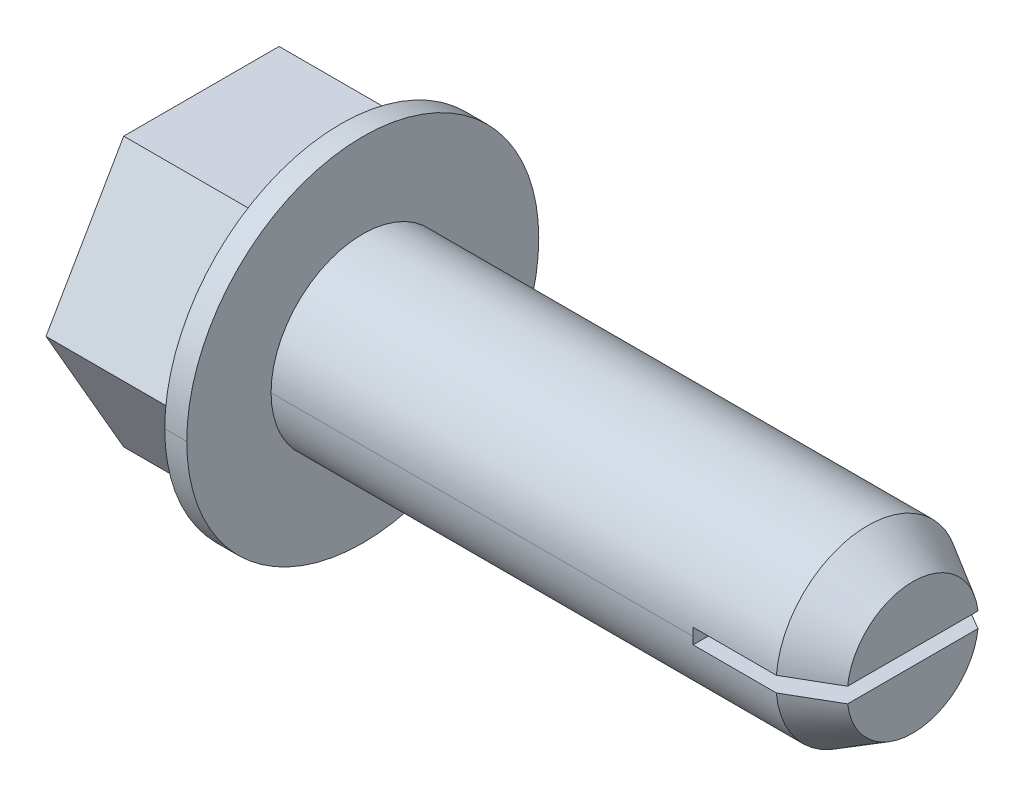
ISO-10303-21;
HEADER;
FILE_DESCRIPTION(('STEP AP214'),'2;1');
FILE_NAME('part.step','',(''),(''),'','','');
FILE_SCHEMA(('AUTOMOTIVE_DESIGN { 1 0 10303 214 1 1 1 1 }'));
ENDSEC;
DATA;
#1=APPLICATION_CONTEXT('core data for automotive mechanical design processes');
#2=APPLICATION_PROTOCOL_DEFINITION('international standard','automotive_design',2000,#1);
#3=PRODUCT_CONTEXT('',#1,'mechanical');
#4=PRODUCT('Part','Part','',(#3));
#5=PRODUCT_RELATED_PRODUCT_CATEGORY('part','',(#4));
#6=PRODUCT_DEFINITION_FORMATION('','',#4);
#7=PRODUCT_DEFINITION_CONTEXT('part definition',#1,'design');
#8=PRODUCT_DEFINITION('design','',#6,#7);
#9=PRODUCT_DEFINITION_SHAPE('','',#8);
#10=(LENGTH_UNIT() NAMED_UNIT(*) SI_UNIT(.MILLI.,.METRE.));
#11=(NAMED_UNIT(*) PLANE_ANGLE_UNIT() SI_UNIT($,.RADIAN.));
#12=(NAMED_UNIT(*) SI_UNIT($,.STERADIAN.) SOLID_ANGLE_UNIT());
#13=UNCERTAINTY_MEASURE_WITH_UNIT(LENGTH_MEASURE(1.E-05),#10,'distance_accuracy_value','');
#14=(GEOMETRIC_REPRESENTATION_CONTEXT(3) GLOBAL_UNCERTAINTY_ASSIGNED_CONTEXT((#13)) GLOBAL_UNIT_ASSIGNED_CONTEXT((#10,
#11,#12)) REPRESENTATION_CONTEXT('',''));
#15=CARTESIAN_POINT('',(0.,0.,0.));
#16=DIRECTION('',(0.,0.,1.));
#17=DIRECTION('',(1.,0.,0.));
#18=AXIS2_PLACEMENT_3D('',#15,#16,#17);
#19=CARTESIAN_POINT('',(14.605,-0.264583333333334,-6.096));
#20=DIRECTION('',(0.,-1.,0.));
#21=DIRECTION('',(0.,0.,-1.));
#22=AXIS2_PLACEMENT_3D('',#19,#20,#21);
#23=PLANE('',#22);
#24=CARTESIAN_POINT('',(17.4882097868151,-0.264583333333334,3.16395648827891));
#25=CARTESIAN_POINT('',(18.0089885370992,-0.264583333333334,2.86223526832155));
#26=CARTESIAN_POINT('',(18.5296581049854,-0.264583333333334,2.56032561142075));
#27=CARTESIAN_POINT('',(19.05,-0.264583333333334,2.25785042678257));
#28=(BOUNDED_CURVE() B_SPLINE_CURVE(3,(#24,#25,#26,#27),.UNSPECIFIED.,.F.,
.F.) B_SPLINE_CURVE_WITH_KNOTS((4,4),(0.00453305455754315,0.0063386613276139),
.UNSPECIFIED.) CURVE() GEOMETRIC_REPRESENTATION_ITEM() RATIONAL_B_SPLINE_CURVE((1.,1.,1.,1.)) REPRESENTATION_ITEM(''));
#29=CARTESIAN_POINT('',(17.4882097868151,-0.264583333333334,3.16395648827891));
#30=VERTEX_POINT('',#29);
#31=CARTESIAN_POINT('',(19.05,-0.264583333333334,2.25785042678257));
#32=VERTEX_POINT('',#31);
#33=EDGE_CURVE('E192',#30,#32,#28,.T.);
#34=ORIENTED_EDGE('',*,*,#33,.T.);
#35=DIRECTION('',(0.,0.,1.));
#36=VECTOR('',#35,1.);
#37=CARTESIAN_POINT('',(19.05,-0.264583333333334,0.));
#38=LINE('',#37,#36);
#39=CARTESIAN_POINT('',(19.05,-0.264583333333334,-2.25785042678257));
#40=VERTEX_POINT('',#39);
#41=EDGE_CURVE('E39',#40,#32,#38,.T.);
#42=ORIENTED_EDGE('',*,*,#41,.F.);
#43=CARTESIAN_POINT('',(19.05,-0.264583333333334,-2.25785042678257));
#44=CARTESIAN_POINT('',(18.5296592052055,-0.264583333333334,-2.56032497186193));
#45=CARTESIAN_POINT('',(18.0089893235556,-0.264583333333334,-2.86223481267582));
#46=CARTESIAN_POINT('',(17.4882097868151,-0.264583333333334,-3.16395648827891));
#47=(BOUNDED_CURVE() B_SPLINE_CURVE(3,(#43,#44,#45,#46),.UNSPECIFIED.,.F.,
.F.) B_SPLINE_CURVE_WITH_KNOTS((4,4),(0.0147270207009754,0.0165431508435462),
.UNSPECIFIED.) CURVE() GEOMETRIC_REPRESENTATION_ITEM() RATIONAL_B_SPLINE_CURVE((1.,1.,1.,1.)) REPRESENTATION_ITEM(''));
#48=CARTESIAN_POINT('',(17.4882097868151,-0.264583333333334,-3.16395648827891));
#49=VERTEX_POINT('',#48);
#50=EDGE_CURVE('E196',#40,#49,#47,.T.);
#51=ORIENTED_EDGE('',*,*,#50,.T.);
#52=DIRECTION('',(1.,0.,0.));
#53=VECTOR('',#52,1.);
#54=CARTESIAN_POINT('',(0.,-0.264583333333333,-3.16395648827891));
#55=LINE('',#54,#53);
#56=CARTESIAN_POINT('',(14.605,-0.264583333333334,-3.16395648827891));
#57=VERTEX_POINT('',#56);
#58=EDGE_CURVE('E287',#57,#49,#55,.T.);
#59=ORIENTED_EDGE('',*,*,#58,.F.);
#60=DIRECTION('',(0.,0.,1.));
#61=VECTOR('',#60,1.);
#62=CARTESIAN_POINT('',(14.605,-0.264583333333334,-6.096));
#63=LINE('',#62,#61);
#64=CARTESIAN_POINT('',(14.605,-0.264583333333334,3.16395648827891));
#65=VERTEX_POINT('',#64);
#66=EDGE_CURVE('E11',#57,#65,#63,.T.);
#67=ORIENTED_EDGE('',*,*,#66,.T.);
#68=DIRECTION('',(-1.,0.,0.));
#69=VECTOR('',#68,1.);
#70=CARTESIAN_POINT('',(0.,-0.264583333333333,3.16395648827891));
#71=LINE('',#70,#69);
#72=EDGE_CURVE('E295',#30,#65,#71,.T.);
#73=ORIENTED_EDGE('',*,*,#72,.F.);
#74=EDGE_LOOP('',(#34,#42,#51,#59,#67,#73));
#75=FACE_BOUND('',#74,.T.);
#76=ADVANCED_FACE('F16',(#75),#23,.F.);
#77=CARTESIAN_POINT('',(14.605,0.264583333333334,-6.096));
#78=DIRECTION('',(0.,1.,0.));
#79=DIRECTION('',(1.,0.,0.));
#80=AXIS2_PLACEMENT_3D('',#77,#78,#79);
#81=PLANE('',#80);
#82=CARTESIAN_POINT('',(17.4882097868151,0.264583333333334,-3.16395648827891));
#83=CARTESIAN_POINT('',(18.0089885370992,0.264583333333334,-2.86223526832155));
#84=CARTESIAN_POINT('',(18.5296581049854,0.264583333333334,-2.56032561142075));
#85=CARTESIAN_POINT('',(19.05,0.264583333333334,-2.25785042678257));
#86=(BOUNDED_CURVE() B_SPLINE_CURVE(3,(#82,#83,#84,#85),.UNSPECIFIED.,.F.,
.F.) B_SPLINE_CURVE_WITH_KNOTS((4,4),(0.00453305455754315,0.0063386613276139),
.UNSPECIFIED.) CURVE() GEOMETRIC_REPRESENTATION_ITEM() RATIONAL_B_SPLINE_CURVE((1.,1.,1.,1.)) REPRESENTATION_ITEM(''));
#87=CARTESIAN_POINT('',(17.4882097868151,0.264583333333334,-3.16395648827891));
#88=VERTEX_POINT('',#87);
#89=CARTESIAN_POINT('',(19.05,0.264583333333334,-2.25785042678257));
#90=VERTEX_POINT('',#89);
#91=EDGE_CURVE('E259',#88,#90,#86,.T.);
#92=ORIENTED_EDGE('',*,*,#91,.T.);
#93=DIRECTION('',(0.,0.,-1.));
#94=VECTOR('',#93,1.);
#95=CARTESIAN_POINT('',(19.05,0.264583333333334,0.));
#96=LINE('',#95,#94);
#97=CARTESIAN_POINT('',(19.05,0.264583333333334,2.25785042678257));
#98=VERTEX_POINT('',#97);
#99=EDGE_CURVE('E280',#98,#90,#96,.T.);
#100=ORIENTED_EDGE('',*,*,#99,.F.);
#101=CARTESIAN_POINT('',(19.05,0.264583333333334,2.25785042678257));
#102=CARTESIAN_POINT('',(18.5296592052055,0.264583333333334,2.56032497186193));
#103=CARTESIAN_POINT('',(18.0089893235556,0.264583333333334,2.86223481267582));
#104=CARTESIAN_POINT('',(17.4882097868151,0.264583333333334,3.16395648827891));
#105=(BOUNDED_CURVE() B_SPLINE_CURVE(3,(#101,#102,#103,#104),.UNSPECIFIED.,.F.,
.F.) B_SPLINE_CURVE_WITH_KNOTS((4,4),(0.0147270207009754,0.0165431508435462),
.UNSPECIFIED.) CURVE() GEOMETRIC_REPRESENTATION_ITEM() RATIONAL_B_SPLINE_CURVE((1.,1.,1.,1.)) REPRESENTATION_ITEM(''));
#106=CARTESIAN_POINT('',(17.4882097868151,0.264583333333334,3.16395648827891));
#107=VERTEX_POINT('',#106);
#108=EDGE_CURVE('E265',#98,#107,#105,.T.);
#109=ORIENTED_EDGE('',*,*,#108,.T.);
#110=DIRECTION('',(1.,0.,0.));
#111=VECTOR('',#110,1.);
#112=CARTESIAN_POINT('',(0.,0.264583333333333,3.16395648827891));
#113=LINE('',#112,#111);
#114=CARTESIAN_POINT('',(14.605,0.264583333333334,3.16395648827891));
#115=VERTEX_POINT('',#114);
#116=EDGE_CURVE('E240',#115,#107,#113,.T.);
#117=ORIENTED_EDGE('',*,*,#116,.F.);
#118=DIRECTION('',(0.,0.,1.));
#119=VECTOR('',#118,1.);
#120=CARTESIAN_POINT('',(14.605,0.264583333333334,-6.096));
#121=LINE('',#120,#119);
#122=CARTESIAN_POINT('',(14.605,0.264583333333334,-3.16395648827891));
#123=VERTEX_POINT('',#122);
#124=EDGE_CURVE('E25',#123,#115,#121,.T.);
#125=ORIENTED_EDGE('',*,*,#124,.F.);
#126=DIRECTION('',(-1.,0.,0.));
#127=VECTOR('',#126,1.);
#128=CARTESIAN_POINT('',(0.,0.264583333333333,-3.16395648827891));
#129=LINE('',#128,#127);
#130=EDGE_CURVE('E249',#88,#123,#129,.T.);
#131=ORIENTED_EDGE('',*,*,#130,.F.);
#132=EDGE_LOOP('',(#92,#100,#109,#117,#125,#131));
#133=FACE_BOUND('',#132,.T.);
#134=ADVANCED_FACE('F362',(#133),#81,.F.);
#135=CARTESIAN_POINT('',(14.605,0.264583333333334,-6.096));
#136=DIRECTION('',(-1.,0.,0.));
#137=DIRECTION('',(0.,0.,1.));
#138=AXIS2_PLACEMENT_3D('',#135,#136,#137);
#139=PLANE('',#138);
#140=ORIENTED_EDGE('',*,*,#124,.T.);
#141=CARTESIAN_POINT('',(14.605,0.,0.));
#142=DIRECTION('',(-1.,0.,0.));
#143=DIRECTION('',(0.,0.,1.));
#144=AXIS2_PLACEMENT_3D('',#141,#142,#143);
#145=CIRCLE('',#144,3.175);
#146=CARTESIAN_POINT('',(14.605,0.,3.175));
#147=VERTEX_POINT('',#146);
#148=EDGE_CURVE('E245',#147,#115,#145,.T.);
#149=ORIENTED_EDGE('',*,*,#148,.F.);
#150=CARTESIAN_POINT('',(14.605,0.,0.));
#151=DIRECTION('',(-1.,0.,0.));
#152=DIRECTION('',(0.,0.,1.));
#153=AXIS2_PLACEMENT_3D('',#150,#151,#152);
#154=CIRCLE('',#153,3.175);
#155=EDGE_CURVE('E299',#65,#147,#154,.T.);
#156=ORIENTED_EDGE('',*,*,#155,.F.);
#157=ORIENTED_EDGE('',*,*,#66,.F.);
#158=CARTESIAN_POINT('',(14.605,0.,0.));
#159=DIRECTION('',(-1.,0.,0.));
#160=DIRECTION('',(0.,0.,1.));
#161=AXIS2_PLACEMENT_3D('',#158,#159,#160);
#162=CIRCLE('',#161,3.175);
#163=CARTESIAN_POINT('',(14.605,0.,-3.175));
#164=VERTEX_POINT('',#163);
#165=EDGE_CURVE('E283',#164,#57,#162,.T.);
#166=ORIENTED_EDGE('',*,*,#165,.F.);
#167=CARTESIAN_POINT('',(14.605,0.,0.));
#168=DIRECTION('',(-1.,0.,0.));
#169=DIRECTION('',(0.,0.,1.));
#170=AXIS2_PLACEMENT_3D('',#167,#168,#169);
#171=CIRCLE('',#170,3.175);
#172=EDGE_CURVE('E223',#123,#164,#171,.T.);
#173=ORIENTED_EDGE('',*,*,#172,.F.);
#174=EDGE_LOOP('',(#140,#149,#156,#157,#166,#173));
#175=FACE_BOUND('',#174,.T.);
#176=ADVANCED_FACE('F367',(#175),#139,.F.);
#177=CARTESIAN_POINT('',(19.05,3.175,0.));
#178=DIRECTION('',(-1.,0.,0.));
#179=DIRECTION('',(0.,0.,1.));
#180=AXIS2_PLACEMENT_3D('',#177,#178,#179);
#181=PLANE('',#180);
#182=CARTESIAN_POINT('',(19.05,0.,0.));
#183=DIRECTION('',(-1.,0.,0.));
#184=DIRECTION('',(0.,0.,1.));
#185=AXIS2_PLACEMENT_3D('',#182,#183,#184);
#186=CIRCLE('',#185,2.2733);
#187=EDGE_CURVE('E19',#40,#32,#186,.T.);
#188=ORIENTED_EDGE('',*,*,#187,.F.);
#189=ORIENTED_EDGE('',*,*,#41,.T.);
#190=EDGE_LOOP('',(#188,#189));
#191=FACE_BOUND('',#190,.T.);
#192=ADVANCED_FACE('F609',(#191),#181,.F.);
#193=CARTESIAN_POINT('',(17.4882097868151,0.,0.));
#194=DIRECTION('',(-1.,0.,0.));
#195=DIRECTION('',(0.,0.,1.));
#196=AXIS2_PLACEMENT_3D('',#193,#194,#195);
#197=CONICAL_SURFACE('',#196,3.175,0.523598775598292);
#198=ORIENTED_EDGE('',*,*,#33,.F.);
#199=CARTESIAN_POINT('',(17.4882097868151,0.,0.));
#200=DIRECTION('',(-1.,0.,0.));
#201=DIRECTION('',(0.,0.,1.));
#202=AXIS2_PLACEMENT_3D('',#199,#200,#201);
#203=CIRCLE('',#202,3.175);
#204=EDGE_CURVE('E291',#49,#30,#203,.T.);
#205=ORIENTED_EDGE('',*,*,#204,.F.);
#206=ORIENTED_EDGE('',*,*,#50,.F.);
#207=ORIENTED_EDGE('',*,*,#187,.T.);
#208=EDGE_LOOP('',(#198,#205,#206,#207));
#209=FACE_BOUND('',#208,.T.);
#210=ADVANCED_FACE('F370',(#209),#197,.T.);
#211=CARTESIAN_POINT('',(500000.,-4.6609,0.));
#212=DIRECTION('',(0.,-1.,0.));
#213=DIRECTION('',(0.,0.,-1.));
#214=AXIS2_PLACEMENT_3D('',#211,#212,#213);
#215=PLANE('',#214);
#216=DIRECTION('',(0.,0.,1.));
#217=VECTOR('',#216,1.);
#218=CARTESIAN_POINT('',(-5.588,-4.6609,0.));
#219=LINE('',#218,#217);
#220=CARTESIAN_POINT('',(-5.588,-4.6609,-2.69097186966593));
#221=VERTEX_POINT('',#220);
#222=CARTESIAN_POINT('',(-5.588,-4.6609,2.69097186966593));
#223=VERTEX_POINT('',#222);
#224=EDGE_CURVE('E170',#221,#223,#219,.T.);
#225=ORIENTED_EDGE('',*,*,#224,.F.);
#226=DIRECTION('',(-1.,0.,0.));
#227=VECTOR('',#226,1.);
#228=CARTESIAN_POINT('',(500000.,-4.6609,-2.69097186966593));
#229=LINE('',#228,#227);
#230=CARTESIAN_POINT('',(-0.762,-4.6609,-2.69097186966593));
#231=VERTEX_POINT('',#230);
#232=EDGE_CURVE('E147',#231,#221,#229,.T.);
#233=ORIENTED_EDGE('',*,*,#232,.F.);
#234=DIRECTION('',(0.,0.,1.));
#235=VECTOR('',#234,1.);
#236=CARTESIAN_POINT('',(-0.762000000008811,-4.6609,0.));
#237=LINE('',#236,#235);
#238=CARTESIAN_POINT('',(-0.762,-4.6609,2.69097186966593));
#239=VERTEX_POINT('',#238);
#240=EDGE_CURVE('E234',#231,#239,#237,.T.);
#241=ORIENTED_EDGE('',*,*,#240,.T.);
#242=DIRECTION('',(-1.,0.,0.));
#243=VECTOR('',#242,1.);
#244=CARTESIAN_POINT('',(500000.,-4.6609,2.69097186966593));
#245=LINE('',#244,#243);
#246=EDGE_CURVE('E189',#239,#223,#245,.T.);
#247=ORIENTED_EDGE('',*,*,#246,.T.);
#248=EDGE_LOOP('',(#225,#233,#241,#247));
#249=FACE_BOUND('',#248,.T.);
#250=ADVANCED_FACE('F337',(#249),#215,.T.);
#251=CARTESIAN_POINT('',(500000.,-10.7431892055105,-0.820639440424718));
#252=DIRECTION('',(0.,-0.5,0.866025403784439));
#253=DIRECTION('',(-1.,0.,0.));
#254=AXIS2_PLACEMENT_3D('',#251,#252,#253);
#255=PLANE('',#254);
#256=DIRECTION('',(0.,0.866025403784439,0.5));
#257=VECTOR('',#256,1.);
#258=CARTESIAN_POINT('',(-5.588,-10.7431892055105,-0.820639440424718));
#259=LINE('',#258,#257);
#260=CARTESIAN_POINT('',(-5.588,0.,5.38194373933185));
#261=VERTEX_POINT('',#260);
#262=EDGE_CURVE('E163',#223,#261,#259,.T.);
#263=ORIENTED_EDGE('',*,*,#262,.F.);
#264=ORIENTED_EDGE('',*,*,#246,.F.);
#265=DIRECTION('',(0.,0.866025403784439,0.5));
#266=VECTOR('',#265,1.);
#267=CARTESIAN_POINT('',(-0.762000000008811,-10.7431892055105,-0.820639440424718));
#268=LINE('',#267,#266);
#269=CARTESIAN_POINT('',(-0.762,0.,5.38194373933185));
#270=VERTEX_POINT('',#269);
#271=EDGE_CURVE('E324',#239,#270,#268,.T.);
#272=ORIENTED_EDGE('',*,*,#271,.T.);
#273=DIRECTION('',(-1.,0.,0.));
#274=VECTOR('',#273,1.);
#275=CARTESIAN_POINT('',(500000.,0.,5.38194373933185));
#276=LINE('',#275,#274);
#277=EDGE_CURVE('E146',#270,#261,#276,.T.);
#278=ORIENTED_EDGE('',*,*,#277,.T.);
#279=EDGE_LOOP('',(#263,#264,#272,#278));
#280=FACE_BOUND('',#279,.T.);
#281=ADVANCED_FACE('F340',(#280),#255,.T.);
#282=CARTESIAN_POINT('',(500000.,-6.08228920551051,8.8935550494225));
#283=DIRECTION('',(0.,0.5,0.866025403784439));
#284=DIRECTION('',(1.,0.,0.));
#285=AXIS2_PLACEMENT_3D('',#282,#283,#284);
#286=PLANE('',#285);
#287=DIRECTION('',(0.,0.866025403784439,-0.5));
#288=VECTOR('',#287,1.);
#289=CARTESIAN_POINT('',(-5.588,-6.08228920551051,8.8935550494225));
#290=LINE('',#289,#288);
#291=CARTESIAN_POINT('',(-5.588,4.6609,2.69097186966593));
#292=VERTEX_POINT('',#291);
#293=EDGE_CURVE('E138',#261,#292,#290,.T.);
#294=ORIENTED_EDGE('',*,*,#293,.F.);
#295=ORIENTED_EDGE('',*,*,#277,.F.);
#296=DIRECTION('',(0.,0.866025403784439,-0.5));
#297=VECTOR('',#296,1.);
#298=CARTESIAN_POINT('',(-0.762000000008811,-6.08228920551051,8.8935550494225));
#299=LINE('',#298,#297);
#300=CARTESIAN_POINT('',(-0.762,4.6609,2.69097186966593));
#301=VERTEX_POINT('',#300);
#302=EDGE_CURVE('E141',#270,#301,#299,.T.);
#303=ORIENTED_EDGE('',*,*,#302,.T.);
#304=DIRECTION('',(-1.,0.,0.));
#305=VECTOR('',#304,1.);
#306=CARTESIAN_POINT('',(500000.,4.6609,2.69097186966593));
#307=LINE('',#306,#305);
#308=EDGE_CURVE('E134',#301,#292,#307,.T.);
#309=ORIENTED_EDGE('',*,*,#308,.T.);
#310=EDGE_LOOP('',(#294,#295,#303,#309));
#311=FACE_BOUND('',#310,.T.);
#312=ADVANCED_FACE('F136',(#311),#286,.T.);
#313=CARTESIAN_POINT('',(500000.,4.6609,0.));
#314=DIRECTION('',(0.,1.,0.));
#315=DIRECTION('',(1.,0.,0.));
#316=AXIS2_PLACEMENT_3D('',#313,#314,#315);
#317=PLANE('',#316);
#318=DIRECTION('',(0.,0.,-1.));
#319=VECTOR('',#318,1.);
#320=CARTESIAN_POINT('',(-5.588,4.6609,0.));
#321=LINE('',#320,#319);
#322=CARTESIAN_POINT('',(-5.588,4.6609,-2.69097186966593));
#323=VERTEX_POINT('',#322);
#324=EDGE_CURVE('E150',#292,#323,#321,.T.);
#325=ORIENTED_EDGE('',*,*,#324,.F.);
#326=ORIENTED_EDGE('',*,*,#308,.F.);
#327=DIRECTION('',(0.,0.,-1.));
#328=VECTOR('',#327,1.);
#329=CARTESIAN_POINT('',(-0.762000000008811,4.6609,0.));
#330=LINE('',#329,#328);
#331=CARTESIAN_POINT('',(-0.762,4.6609,-2.69097186966593));
#332=VERTEX_POINT('',#331);
#333=EDGE_CURVE('E310',#301,#332,#330,.T.);
#334=ORIENTED_EDGE('',*,*,#333,.T.);
#335=DIRECTION('',(-1.,0.,0.));
#336=VECTOR('',#335,1.);
#337=CARTESIAN_POINT('',(500000.,4.6609,-2.69097186966593));
#338=LINE('',#337,#336);
#339=EDGE_CURVE('E152',#332,#323,#338,.T.);
#340=ORIENTED_EDGE('',*,*,#339,.T.);
#341=EDGE_LOOP('',(#325,#326,#334,#340));
#342=FACE_BOUND('',#341,.T.);
#343=ADVANCED_FACE('F151',(#342),#317,.T.);
#344=CARTESIAN_POINT('',(500000.,-10.7431892055105,0.820639440424721));
#345=DIRECTION('',(0.,-0.5,-0.866025403784439));
#346=DIRECTION('',(0.,-0.866025403784439,0.5));
#347=AXIS2_PLACEMENT_3D('',#344,#345,#346);
#348=PLANE('',#347);
#349=DIRECTION('',(-1.,0.,0.));
#350=VECTOR('',#349,1.);
#351=CARTESIAN_POINT('',(500000.,0.,-5.38194373933185));
#352=LINE('',#351,#350);
#353=CARTESIAN_POINT('',(-0.761999999895125,0.,-5.38194373933185));
#354=VERTEX_POINT('',#353);
#355=CARTESIAN_POINT('',(-5.588,0.,-5.38194373933185));
#356=VERTEX_POINT('',#355);
#357=EDGE_CURVE('E182',#354,#356,#352,.T.);
#358=ORIENTED_EDGE('',*,*,#357,.F.);
#359=DIRECTION('',(0.,-0.866025403784439,0.5));
#360=VECTOR('',#359,1.);
#361=CARTESIAN_POINT('',(-0.762000000008811,-10.7431892055105,0.820639440424721));
#362=LINE('',#361,#360);
#363=EDGE_CURVE('E238',#354,#231,#362,.T.);
#364=ORIENTED_EDGE('',*,*,#363,.T.);
#365=ORIENTED_EDGE('',*,*,#232,.T.);
#366=DIRECTION('',(0.,-0.866025403784439,0.5));
#367=VECTOR('',#366,1.);
#368=CARTESIAN_POINT('',(-5.588,-10.7431892055105,0.820639440424721));
#369=LINE('',#368,#367);
#370=EDGE_CURVE('E252',#356,#221,#369,.T.);
#371=ORIENTED_EDGE('',*,*,#370,.F.);
#372=EDGE_LOOP('',(#358,#364,#365,#371));
#373=FACE_BOUND('',#372,.T.);
#374=ADVANCED_FACE('F333',(#373),#348,.T.);
#375=CARTESIAN_POINT('',(500000.,-6.08228920551051,-8.8935550494225));
#376=DIRECTION('',(0.,0.5,-0.866025403784439));
#377=DIRECTION('',(-1.,0.,0.));
#378=AXIS2_PLACEMENT_3D('',#375,#376,#377);
#379=PLANE('',#378);
#380=DIRECTION('',(0.,-0.866025403784439,-0.5));
#381=VECTOR('',#380,1.);
#382=CARTESIAN_POINT('',(-5.588,-6.08228920551051,-8.8935550494225));
#383=LINE('',#382,#381);
#384=EDGE_CURVE('E157',#323,#356,#383,.T.);
#385=ORIENTED_EDGE('',*,*,#384,.F.);
#386=ORIENTED_EDGE('',*,*,#339,.F.);
#387=DIRECTION('',(0.,-0.866025403784439,-0.5));
#388=VECTOR('',#387,1.);
#389=CARTESIAN_POINT('',(-0.762000000008811,-6.08228920551051,-8.8935550494225));
#390=LINE('',#389,#388);
#391=EDGE_CURVE('E306',#332,#354,#390,.T.);
#392=ORIENTED_EDGE('',*,*,#391,.T.);
#393=ORIENTED_EDGE('',*,*,#357,.T.);
#394=EDGE_LOOP('',(#385,#386,#392,#393));
#395=FACE_BOUND('',#394,.T.);
#396=ADVANCED_FACE('F346',(#395),#379,.T.);
#397=CARTESIAN_POINT('',(0.,0.,0.));
#398=DIRECTION('',(-1.,0.,0.));
#399=DIRECTION('',(0.,0.,1.));
#400=AXIS2_PLACEMENT_3D('',#397,#398,#399);
#401=CYLINDRICAL_SURFACE('',#400,3.72872);
#402=DIRECTION('',(-1.,0.,0.));
#403=VECTOR('',#402,1.);
#404=CARTESIAN_POINT('',(0.,0.,-3.72872));
#405=LINE('',#404,#403);
#406=CARTESIAN_POINT('',(-4.6228,0.,-3.72872));
#407=VERTEX_POINT('',#406);
#408=CARTESIAN_POINT('',(-5.588,0.,-3.72872));
#409=VERTEX_POINT('',#408);
#410=EDGE_CURVE('E556',#407,#409,#405,.T.);
#411=ORIENTED_EDGE('',*,*,#410,.F.);
#412=CARTESIAN_POINT('',(-4.6228,0.,0.));
#413=DIRECTION('',(-1.,0.,0.));
#414=DIRECTION('',(0.,0.,1.));
#415=AXIS2_PLACEMENT_3D('',#412,#413,#414);
#416=CIRCLE('',#415,3.72872);
#417=CARTESIAN_POINT('',(-4.6228,0.,3.72872));
#418=VERTEX_POINT('',#417);
#419=EDGE_CURVE('E253',#418,#407,#416,.T.);
#420=ORIENTED_EDGE('',*,*,#419,.F.);
#421=DIRECTION('',(-1.,0.,0.));
#422=VECTOR('',#421,1.);
#423=CARTESIAN_POINT('',(0.,0.,3.72872));
#424=LINE('',#423,#422);
#425=CARTESIAN_POINT('',(-5.588,0.,3.72872));
#426=VERTEX_POINT('',#425);
#427=EDGE_CURVE('E462',#418,#426,#424,.T.);
#428=ORIENTED_EDGE('',*,*,#427,.T.);
#429=CARTESIAN_POINT('',(-5.588,0.,0.));
#430=DIRECTION('',(-1.,0.,0.));
#431=DIRECTION('',(0.,0.,1.));
#432=AXIS2_PLACEMENT_3D('',#429,#430,#431);
#433=CIRCLE('',#432,3.72872);
#434=EDGE_CURVE('E176',#426,#409,#433,.T.);
#435=ORIENTED_EDGE('',*,*,#434,.T.);
#436=EDGE_LOOP('',(#411,#420,#428,#435));
#437=FACE_BOUND('',#436,.T.);
#438=ADVANCED_FACE('F348',(#437),#401,.F.);
#439=CARTESIAN_POINT('',(-5.588,4.6609,0.));
#440=DIRECTION('',(1.,0.,0.));
#441=DIRECTION('',(0.,1.,0.));
#442=AXIS2_PLACEMENT_3D('',#439,#440,#441);
#443=PLANE('',#442);
#444=ORIENTED_EDGE('',*,*,#434,.F.);
#445=CARTESIAN_POINT('',(-5.588,0.,0.));
#446=DIRECTION('',(-1.,0.,0.));
#447=DIRECTION('',(0.,0.,1.));
#448=AXIS2_PLACEMENT_3D('',#445,#446,#447);
#449=CIRCLE('',#448,3.72872);
#450=EDGE_CURVE('E454',#409,#426,#449,.T.);
#451=ORIENTED_EDGE('',*,*,#450,.F.);
#452=EDGE_LOOP('',(#444,#451));
#453=FACE_BOUND('',#452,.T.);
#454=ORIENTED_EDGE('',*,*,#370,.T.);
#455=ORIENTED_EDGE('',*,*,#224,.T.);
#456=ORIENTED_EDGE('',*,*,#262,.T.);
#457=ORIENTED_EDGE('',*,*,#293,.T.);
#458=ORIENTED_EDGE('',*,*,#324,.T.);
#459=ORIENTED_EDGE('',*,*,#384,.T.);
#460=EDGE_LOOP('',(#454,#455,#456,#457,#458,#459));
#461=FACE_BOUND('',#460,.T.);
#462=ADVANCED_FACE('F160',(#453,#461),#443,.F.);
#463=CARTESIAN_POINT('',(-0.762,6.096,0.));
#464=DIRECTION('',(1.,0.,0.));
#465=DIRECTION('',(0.,1.,0.));
#466=AXIS2_PLACEMENT_3D('',#463,#464,#465);
#467=PLANE('',#466);
#468=ORIENTED_EDGE('',*,*,#240,.F.);
#469=ORIENTED_EDGE('',*,*,#363,.F.);
#470=ORIENTED_EDGE('',*,*,#391,.F.);
#471=ORIENTED_EDGE('',*,*,#333,.F.);
#472=ORIENTED_EDGE('',*,*,#302,.F.);
#473=ORIENTED_EDGE('',*,*,#271,.F.);
#474=EDGE_LOOP('',(#468,#469,#470,#471,#472,#473));
#475=FACE_BOUND('',#474,.T.);
#476=CARTESIAN_POINT('',(-0.762,0.,0.));
#477=DIRECTION('',(-1.,0.,0.));
#478=DIRECTION('',(0.,0.,1.));
#479=AXIS2_PLACEMENT_3D('',#476,#477,#478);
#480=CIRCLE('',#479,6.096);
#481=CARTESIAN_POINT('',(-0.762,0.,6.096));
#482=VERTEX_POINT('',#481);
#483=CARTESIAN_POINT('',(-0.762,0.,-6.096));
#484=VERTEX_POINT('',#483);
#485=EDGE_CURVE('E442',#482,#484,#480,.T.);
#486=ORIENTED_EDGE('',*,*,#485,.T.);
#487=CARTESIAN_POINT('',(-0.762,0.,0.));
#488=DIRECTION('',(-1.,0.,0.));
#489=DIRECTION('',(0.,0.,1.));
#490=AXIS2_PLACEMENT_3D('',#487,#488,#489);
#491=CIRCLE('',#490,6.096);
#492=EDGE_CURVE('E239',#484,#482,#491,.T.);
#493=ORIENTED_EDGE('',*,*,#492,.T.);
#494=EDGE_LOOP('',(#486,#493));
#495=FACE_BOUND('',#494,.T.);
#496=ADVANCED_FACE('F342',(#475,#495),#467,.F.);
#497=CARTESIAN_POINT('',(0.,0.,0.));
#498=DIRECTION('',(-1.,0.,0.));
#499=DIRECTION('',(0.,0.,1.));
#500=AXIS2_PLACEMENT_3D('',#497,#498,#499);
#501=CYLINDRICAL_SURFACE('',#500,6.096);
#502=DIRECTION('',(-1.,0.,0.));
#503=VECTOR('',#502,1.);
#504=CARTESIAN_POINT('',(0.,0.,-6.096));
#505=LINE('',#504,#503);
#506=CARTESIAN_POINT('',(0.,0.,-6.096));
#507=VERTEX_POINT('',#506);
#508=EDGE_CURVE('E451',#507,#484,#505,.T.);
#509=ORIENTED_EDGE('',*,*,#508,.F.);
#510=CARTESIAN_POINT('',(0.,0.,0.));
#511=DIRECTION('',(-1.,0.,0.));
#512=DIRECTION('',(0.,0.,1.));
#513=AXIS2_PLACEMENT_3D('',#510,#511,#512);
#514=CIRCLE('',#513,6.096);
#515=CARTESIAN_POINT('',(0.,0.,6.096));
#516=VERTEX_POINT('',#515);
#517=EDGE_CURVE('E257',#507,#516,#514,.T.);
#518=ORIENTED_EDGE('',*,*,#517,.T.);
#519=DIRECTION('',(-1.,0.,0.));
#520=VECTOR('',#519,1.);
#521=CARTESIAN_POINT('',(0.,0.,6.096));
#522=LINE('',#521,#520);
#523=EDGE_CURVE('E437',#516,#482,#522,.T.);
#524=ORIENTED_EDGE('',*,*,#523,.T.);
#525=ORIENTED_EDGE('',*,*,#492,.F.);
#526=EDGE_LOOP('',(#509,#518,#524,#525));
#527=FACE_BOUND('',#526,.T.);
#528=ADVANCED_FACE('F677',(#527),#501,.T.);
#529=CARTESIAN_POINT('',(0.,3.175,0.));
#530=DIRECTION('',(-1.,0.,0.));
#531=DIRECTION('',(0.,0.,1.));
#532=AXIS2_PLACEMENT_3D('',#529,#530,#531);
#533=PLANE('',#532);
#534=CARTESIAN_POINT('',(0.,0.,0.));
#535=DIRECTION('',(-1.,0.,0.));
#536=DIRECTION('',(0.,0.,1.));
#537=AXIS2_PLACEMENT_3D('',#534,#535,#536);
#538=CIRCLE('',#537,3.175);
#539=CARTESIAN_POINT('',(0.,0.,3.175));
#540=VERTEX_POINT('',#539);
#541=CARTESIAN_POINT('',(0.,0.,-3.175));
#542=VERTEX_POINT('',#541);
#543=EDGE_CURVE('E228',#540,#542,#538,.T.);
#544=ORIENTED_EDGE('',*,*,#543,.T.);
#545=CARTESIAN_POINT('',(0.,0.,0.));
#546=DIRECTION('',(-1.,0.,0.));
#547=DIRECTION('',(0.,0.,1.));
#548=AXIS2_PLACEMENT_3D('',#545,#546,#547);
#549=CIRCLE('',#548,3.175);
#550=EDGE_CURVE('E258',#542,#540,#549,.T.);
#551=ORIENTED_EDGE('',*,*,#550,.T.);
#552=EDGE_LOOP('',(#544,#551));
#553=FACE_BOUND('',#552,.T.);
#554=CARTESIAN_POINT('',(0.,0.,0.));
#555=DIRECTION('',(-1.,0.,0.));
#556=DIRECTION('',(0.,0.,1.));
#557=AXIS2_PLACEMENT_3D('',#554,#555,#556);
#558=CIRCLE('',#557,6.096);
#559=EDGE_CURVE('E458',#516,#507,#558,.T.);
#560=ORIENTED_EDGE('',*,*,#559,.F.);
#561=ORIENTED_EDGE('',*,*,#517,.F.);
#562=EDGE_LOOP('',(#560,#561));
#563=FACE_BOUND('',#562,.T.);
#564=ADVANCED_FACE('F429',(#553,#563),#533,.F.);
#565=CARTESIAN_POINT('',(-4.6228,3.72872,0.));
#566=DIRECTION('',(1.,0.,0.));
#567=DIRECTION('',(0.,1.,0.));
#568=AXIS2_PLACEMENT_3D('',#565,#566,#567);
#569=PLANE('',#568);
#570=ORIENTED_EDGE('',*,*,#419,.T.);
#571=CARTESIAN_POINT('',(-4.6228,0.,0.));
#572=DIRECTION('',(-1.,0.,0.));
#573=DIRECTION('',(0.,0.,1.));
#574=AXIS2_PLACEMENT_3D('',#571,#572,#573);
#575=CIRCLE('',#574,3.72872);
#576=EDGE_CURVE('E563',#407,#418,#575,.T.);
#577=ORIENTED_EDGE('',*,*,#576,.T.);
#578=EDGE_LOOP('',(#570,#577));
#579=FACE_BOUND('',#578,.T.);
#580=ADVANCED_FACE('F576',(#579),#569,.F.);
#581=CARTESIAN_POINT('',(0.,0.,0.));
#582=DIRECTION('',(-1.,0.,0.));
#583=DIRECTION('',(0.,0.,1.));
#584=AXIS2_PLACEMENT_3D('',#581,#582,#583);
#585=CYLINDRICAL_SURFACE('',#584,3.175);
#586=DIRECTION('',(-1.,0.,0.));
#587=VECTOR('',#586,1.);
#588=CARTESIAN_POINT('',(0.,0.,-3.175));
#589=LINE('',#588,#587);
#590=EDGE_CURVE('E225',#164,#542,#589,.T.);
#591=ORIENTED_EDGE('',*,*,#590,.F.);
#592=ORIENTED_EDGE('',*,*,#165,.T.);
#593=ORIENTED_EDGE('',*,*,#58,.T.);
#594=ORIENTED_EDGE('',*,*,#204,.T.);
#595=ORIENTED_EDGE('',*,*,#72,.T.);
#596=ORIENTED_EDGE('',*,*,#155,.T.);
#597=DIRECTION('',(-1.,0.,0.));
#598=VECTOR('',#597,1.);
#599=CARTESIAN_POINT('',(0.,0.,3.175));
#600=LINE('',#599,#598);
#601=EDGE_CURVE('E233',#147,#540,#600,.T.);
#602=ORIENTED_EDGE('',*,*,#601,.T.);
#603=ORIENTED_EDGE('',*,*,#550,.F.);
#604=EDGE_LOOP('',(#591,#592,#593,#594,#595,#596,#602,#603));
#605=FACE_BOUND('',#604,.T.);
#606=ADVANCED_FACE('F373',(#605),#585,.T.);
#607=CARTESIAN_POINT('',(19.05,3.175,0.));
#608=DIRECTION('',(-1.,0.,0.));
#609=DIRECTION('',(0.,0.,1.));
#610=AXIS2_PLACEMENT_3D('',#607,#608,#609);
#611=PLANE('',#610);
#612=CARTESIAN_POINT('',(19.05,0.,0.));
#613=DIRECTION('',(-1.,0.,0.));
#614=DIRECTION('',(0.,0.,1.));
#615=AXIS2_PLACEMENT_3D('',#612,#613,#614);
#616=CIRCLE('',#615,2.2733);
#617=EDGE_CURVE('E273',#98,#90,#616,.T.);
#618=ORIENTED_EDGE('',*,*,#617,.F.);
#619=ORIENTED_EDGE('',*,*,#99,.T.);
#620=EDGE_LOOP('',(#618,#619));
#621=FACE_BOUND('',#620,.T.);
#622=ADVANCED_FACE('F736',(#621),#611,.F.);
#623=CARTESIAN_POINT('',(17.4882097868151,0.,0.));
#624=DIRECTION('',(-1.,0.,0.));
#625=DIRECTION('',(0.,0.,1.));
#626=AXIS2_PLACEMENT_3D('',#623,#624,#625);
#627=CONICAL_SURFACE('',#626,3.175,0.523598775598292);
#628=ORIENTED_EDGE('',*,*,#91,.F.);
#629=CARTESIAN_POINT('',(17.4882097868151,0.,0.));
#630=DIRECTION('',(-1.,0.,0.));
#631=DIRECTION('',(0.,0.,1.));
#632=AXIS2_PLACEMENT_3D('',#629,#630,#631);
#633=CIRCLE('',#632,3.175);
#634=EDGE_CURVE('E244',#107,#88,#633,.T.);
#635=ORIENTED_EDGE('',*,*,#634,.F.);
#636=ORIENTED_EDGE('',*,*,#108,.F.);
#637=ORIENTED_EDGE('',*,*,#617,.T.);
#638=EDGE_LOOP('',(#628,#635,#636,#637));
#639=FACE_BOUND('',#638,.T.);
#640=ADVANCED_FACE('F740',(#639),#627,.T.);
#641=CARTESIAN_POINT('',(0.,0.,0.));
#642=DIRECTION('',(-1.,0.,0.));
#643=DIRECTION('',(0.,0.,1.));
#644=AXIS2_PLACEMENT_3D('',#641,#642,#643);
#645=CYLINDRICAL_SURFACE('',#644,3.175);
#646=ORIENTED_EDGE('',*,*,#172,.T.);
#647=ORIENTED_EDGE('',*,*,#590,.T.);
#648=ORIENTED_EDGE('',*,*,#543,.F.);
#649=ORIENTED_EDGE('',*,*,#601,.F.);
#650=ORIENTED_EDGE('',*,*,#148,.T.);
#651=ORIENTED_EDGE('',*,*,#116,.T.);
#652=ORIENTED_EDGE('',*,*,#634,.T.);
#653=ORIENTED_EDGE('',*,*,#130,.T.);
#654=EDGE_LOOP('',(#646,#647,#648,#649,#650,#651,#652,#653));
#655=FACE_BOUND('',#654,.T.);
#656=ADVANCED_FACE('F432',(#655),#645,.T.);
#657=CARTESIAN_POINT('',(0.,0.,0.));
#658=DIRECTION('',(-1.,0.,0.));
#659=DIRECTION('',(0.,0.,1.));
#660=AXIS2_PLACEMENT_3D('',#657,#658,#659);
#661=CYLINDRICAL_SURFACE('',#660,6.096);
#662=ORIENTED_EDGE('',*,*,#559,.T.);
#663=ORIENTED_EDGE('',*,*,#508,.T.);
#664=ORIENTED_EDGE('',*,*,#485,.F.);
#665=ORIENTED_EDGE('',*,*,#523,.F.);
#666=EDGE_LOOP('',(#662,#663,#664,#665));
#667=FACE_BOUND('',#666,.T.);
#668=ADVANCED_FACE('F761',(#667),#661,.T.);
#669=CARTESIAN_POINT('',(0.,0.,0.));
#670=DIRECTION('',(-1.,0.,0.));
#671=DIRECTION('',(0.,0.,1.));
#672=AXIS2_PLACEMENT_3D('',#669,#670,#671);
#673=CYLINDRICAL_SURFACE('',#672,3.72872);
#674=ORIENTED_EDGE('',*,*,#576,.F.);
#675=ORIENTED_EDGE('',*,*,#410,.T.);
#676=ORIENTED_EDGE('',*,*,#450,.T.);
#677=ORIENTED_EDGE('',*,*,#427,.F.);
#678=EDGE_LOOP('',(#674,#675,#676,#677));
#679=FACE_BOUND('',#678,.T.);
#680=ADVANCED_FACE('F521',(#679),#673,.F.);
#681=CLOSED_SHELL('',(#76,#134,#176,#192,#210,#250,#281,#312,#343,#374,#396,#438,#462,#496,#528,
#564,#580,#606,#622,#640,#656,#668,#680));
#682=MANIFOLD_SOLID_BREP('B1',#681);
#683=ADVANCED_BREP_SHAPE_REPRESENTATION('',(#18,#682),#14);
#684=SHAPE_DEFINITION_REPRESENTATION(#9,#683);
ENDSEC;
END-ISO-10303-21;
